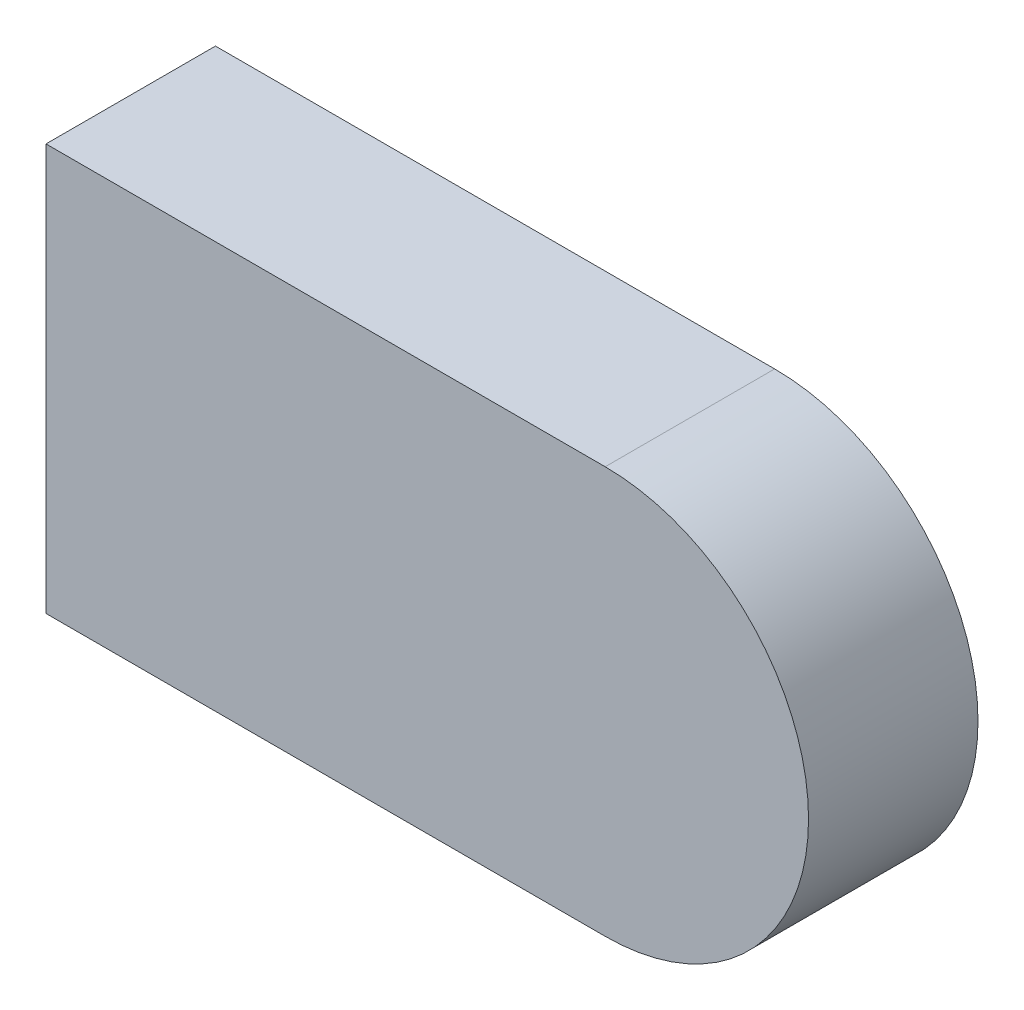
ISO-10303-21;
HEADER;
FILE_DESCRIPTION(('STEP AP214'),'2;1');
FILE_NAME('part.step','',(''),(''),'','','');
FILE_SCHEMA(('AUTOMOTIVE_DESIGN { 1 0 10303 214 1 1 1 1 }'));
ENDSEC;
DATA;
#1=APPLICATION_CONTEXT('core data for automotive mechanical design processes');
#2=APPLICATION_PROTOCOL_DEFINITION('international standard','automotive_design',2000,#1);
#3=PRODUCT_CONTEXT('',#1,'mechanical');
#4=PRODUCT('Part','Part','',(#3));
#5=PRODUCT_RELATED_PRODUCT_CATEGORY('part','',(#4));
#6=PRODUCT_DEFINITION_FORMATION('','',#4);
#7=PRODUCT_DEFINITION_CONTEXT('part definition',#1,'design');
#8=PRODUCT_DEFINITION('design','',#6,#7);
#9=PRODUCT_DEFINITION_SHAPE('','',#8);
#10=(LENGTH_UNIT() NAMED_UNIT(*) SI_UNIT(.MILLI.,.METRE.));
#11=(NAMED_UNIT(*) PLANE_ANGLE_UNIT() SI_UNIT($,.RADIAN.));
#12=(NAMED_UNIT(*) SI_UNIT($,.STERADIAN.) SOLID_ANGLE_UNIT());
#13=UNCERTAINTY_MEASURE_WITH_UNIT(LENGTH_MEASURE(1.E-05),#10,'distance_accuracy_value','');
#14=(GEOMETRIC_REPRESENTATION_CONTEXT(3) GLOBAL_UNCERTAINTY_ASSIGNED_CONTEXT((#13)) GLOBAL_UNIT_ASSIGNED_CONTEXT((#10,
#11,#12)) REPRESENTATION_CONTEXT('',''));
#15=CARTESIAN_POINT('',(0.,0.,0.));
#16=DIRECTION('',(0.,0.,1.));
#17=DIRECTION('',(1.,0.,0.));
#18=AXIS2_PLACEMENT_3D('',#15,#16,#17);
#19=CARTESIAN_POINT('',(-4.05,-3.37,0.));
#20=DIRECTION('',(0.,1.,0.));
#21=DIRECTION('',(1.,0.,0.));
#22=AXIS2_PLACEMENT_3D('',#19,#20,#21);
#23=PLANE('',#22);
#24=DIRECTION('',(1.,0.,0.));
#25=VECTOR('',#24,1.);
#26=CARTESIAN_POINT('',(-4.05,-3.37,0.));
#27=LINE('',#26,#25);
#28=CARTESIAN_POINT('',(-4.05,-3.37,0.));
#29=VERTEX_POINT('',#28);
#30=CARTESIAN_POINT('',(-3.72,-3.37,0.));
#31=VERTEX_POINT('',#30);
#32=EDGE_CURVE('E11',#29,#31,#27,.T.);
#33=ORIENTED_EDGE('',*,*,#32,.T.);
#34=DIRECTION('',(0.,0.,1.));
#35=VECTOR('',#34,1.);
#36=CARTESIAN_POINT('',(-3.72,-3.37,0.));
#37=LINE('',#36,#35);
#38=CARTESIAN_POINT('',(-3.72,-3.37,0.1));
#39=VERTEX_POINT('',#38);
#40=EDGE_CURVE('E24',#31,#39,#37,.T.);
#41=ORIENTED_EDGE('',*,*,#40,.T.);
#42=DIRECTION('',(1.,0.,0.));
#43=VECTOR('',#42,1.);
#44=CARTESIAN_POINT('',(-4.05,-3.37,0.1));
#45=LINE('',#44,#43);
#46=CARTESIAN_POINT('',(-4.05,-3.37,0.1));
#47=VERTEX_POINT('',#46);
#48=EDGE_CURVE('E88',#47,#39,#45,.T.);
#49=ORIENTED_EDGE('',*,*,#48,.F.);
#50=DIRECTION('',(0.,0.,1.));
#51=VECTOR('',#50,1.);
#52=CARTESIAN_POINT('',(-4.05,-3.37,0.));
#53=LINE('',#52,#51);
#54=EDGE_CURVE('E36',#29,#47,#53,.T.);
#55=ORIENTED_EDGE('',*,*,#54,.F.);
#56=EDGE_LOOP('',(#33,#41,#49,#55));
#57=FACE_BOUND('',#56,.T.);
#58=ADVANCED_FACE('F17',(#57),#23,.F.);
#59=CARTESIAN_POINT('',(-3.72,-3.25,0.));
#60=DIRECTION('',(0.,0.,-1.));
#61=DIRECTION('',(1.,0.,0.));
#62=AXIS2_PLACEMENT_3D('',#59,#60,#61);
#63=CYLINDRICAL_SURFACE('',#62,0.12);
#64=CARTESIAN_POINT('',(-3.72,-3.25,0.));
#65=DIRECTION('',(0.,0.,1.));
#66=DIRECTION('',(1.,0.,0.));
#67=AXIS2_PLACEMENT_3D('',#64,#65,#66);
#68=CIRCLE('',#67,0.12);
#69=CARTESIAN_POINT('',(-3.72,-3.13,0.));
#70=VERTEX_POINT('',#69);
#71=EDGE_CURVE('E85',#31,#70,#68,.T.);
#72=ORIENTED_EDGE('',*,*,#71,.T.);
#73=DIRECTION('',(0.,0.,1.));
#74=VECTOR('',#73,1.);
#75=CARTESIAN_POINT('',(-3.72,-3.13,0.));
#76=LINE('',#75,#74);
#77=CARTESIAN_POINT('',(-3.72,-3.13,0.1));
#78=VERTEX_POINT('',#77);
#79=EDGE_CURVE('E73',#70,#78,#76,.T.);
#80=ORIENTED_EDGE('',*,*,#79,.T.);
#81=CARTESIAN_POINT('',(-3.72,-3.25,0.1));
#82=DIRECTION('',(0.,0.,1.));
#83=DIRECTION('',(1.,0.,0.));
#84=AXIS2_PLACEMENT_3D('',#81,#82,#83);
#85=CIRCLE('',#84,0.12);
#86=EDGE_CURVE('E66',#39,#78,#85,.T.);
#87=ORIENTED_EDGE('',*,*,#86,.F.);
#88=ORIENTED_EDGE('',*,*,#40,.F.);
#89=EDGE_LOOP('',(#72,#80,#87,#88));
#90=FACE_BOUND('',#89,.T.);
#91=ADVANCED_FACE('F89',(#90),#63,.T.);
#92=CARTESIAN_POINT('',(-4.05,-3.13,0.));
#93=DIRECTION('',(0.,1.,0.));
#94=DIRECTION('',(1.,0.,0.));
#95=AXIS2_PLACEMENT_3D('',#92,#93,#94);
#96=PLANE('',#95);
#97=DIRECTION('',(0.,0.,1.));
#98=VECTOR('',#97,1.);
#99=CARTESIAN_POINT('',(-4.05,-3.13,0.));
#100=LINE('',#99,#98);
#101=CARTESIAN_POINT('',(-4.05,-3.13,0.));
#102=VERTEX_POINT('',#101);
#103=CARTESIAN_POINT('',(-4.05,-3.13,0.1));
#104=VERTEX_POINT('',#103);
#105=EDGE_CURVE('E56',#102,#104,#100,.T.);
#106=ORIENTED_EDGE('',*,*,#105,.T.);
#107=DIRECTION('',(1.,0.,0.));
#108=VECTOR('',#107,1.);
#109=CARTESIAN_POINT('',(-4.05,-3.13,0.1));
#110=LINE('',#109,#108);
#111=EDGE_CURVE('E67',#104,#78,#110,.T.);
#112=ORIENTED_EDGE('',*,*,#111,.T.);
#113=ORIENTED_EDGE('',*,*,#79,.F.);
#114=DIRECTION('',(1.,0.,0.));
#115=VECTOR('',#114,1.);
#116=CARTESIAN_POINT('',(-4.05,-3.13,0.));
#117=LINE('',#116,#115);
#118=EDGE_CURVE('E71',#102,#70,#117,.T.);
#119=ORIENTED_EDGE('',*,*,#118,.F.);
#120=EDGE_LOOP('',(#106,#112,#113,#119));
#121=FACE_BOUND('',#120,.T.);
#122=ADVANCED_FACE('F72',(#121),#96,.T.);
#123=CARTESIAN_POINT('',(-4.05,-3.37,0.));
#124=DIRECTION('',(-1.,0.,0.));
#125=DIRECTION('',(0.,1.,0.));
#126=AXIS2_PLACEMENT_3D('',#123,#124,#125);
#127=PLANE('',#126);
#128=ORIENTED_EDGE('',*,*,#54,.T.);
#129=DIRECTION('',(0.,1.,0.));
#130=VECTOR('',#129,1.);
#131=CARTESIAN_POINT('',(-4.05,-3.37,0.1));
#132=LINE('',#131,#130);
#133=EDGE_CURVE('E62',#47,#104,#132,.T.);
#134=ORIENTED_EDGE('',*,*,#133,.T.);
#135=ORIENTED_EDGE('',*,*,#105,.F.);
#136=DIRECTION('',(0.,1.,0.));
#137=VECTOR('',#136,1.);
#138=CARTESIAN_POINT('',(-4.05,-3.37,0.));
#139=LINE('',#138,#137);
#140=EDGE_CURVE('E60',#29,#102,#139,.T.);
#141=ORIENTED_EDGE('',*,*,#140,.F.);
#142=EDGE_LOOP('',(#128,#134,#135,#141));
#143=FACE_BOUND('',#142,.T.);
#144=ADVANCED_FACE('F58',(#143),#127,.T.);
#145=CARTESIAN_POINT('',(-3.849490847913,-3.25,0.));
#146=DIRECTION('',(0.,0.,1.));
#147=DIRECTION('',(1.,0.,0.));
#148=AXIS2_PLACEMENT_3D('',#145,#146,#147);
#149=PLANE('',#148);
#150=ORIENTED_EDGE('',*,*,#140,.T.);
#151=ORIENTED_EDGE('',*,*,#118,.T.);
#152=ORIENTED_EDGE('',*,*,#71,.F.);
#153=ORIENTED_EDGE('',*,*,#32,.F.);
#154=EDGE_LOOP('',(#150,#151,#152,#153));
#155=FACE_BOUND('',#154,.T.);
#156=ADVANCED_FACE('F77',(#155),#149,.F.);
#157=CARTESIAN_POINT('',(-3.849490847913,-3.25,0.1));
#158=DIRECTION('',(0.,0.,1.));
#159=DIRECTION('',(1.,0.,0.));
#160=AXIS2_PLACEMENT_3D('',#157,#158,#159);
#161=PLANE('',#160);
#162=ORIENTED_EDGE('',*,*,#48,.T.);
#163=ORIENTED_EDGE('',*,*,#86,.T.);
#164=ORIENTED_EDGE('',*,*,#111,.F.);
#165=ORIENTED_EDGE('',*,*,#133,.F.);
#166=EDGE_LOOP('',(#162,#163,#164,#165));
#167=FACE_BOUND('',#166,.T.);
#168=ADVANCED_FACE('F91',(#167),#161,.T.);
#169=CLOSED_SHELL('',(#58,#91,#122,#144,#156,#168));
#170=MANIFOLD_SOLID_BREP('B1',#169);
#171=ADVANCED_BREP_SHAPE_REPRESENTATION('',(#18,#170),#14);
#172=SHAPE_DEFINITION_REPRESENTATION(#9,#171);
ENDSEC;
END-ISO-10303-21;
